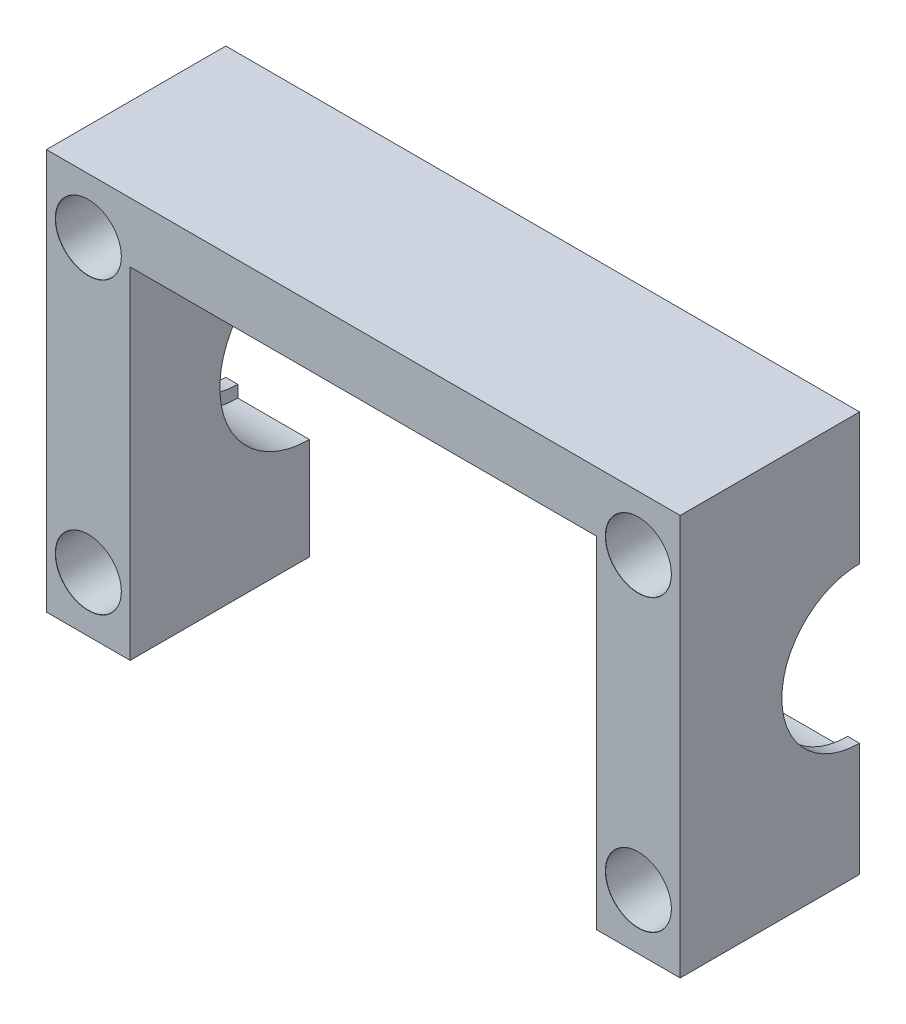
ISO-10303-21;
HEADER;
FILE_DESCRIPTION(('STEP AP214'),'2;1');
FILE_NAME('part.step','',(''),(''),'','','');
FILE_SCHEMA(('AUTOMOTIVE_DESIGN { 1 0 10303 214 1 1 1 1 }'));
ENDSEC;
DATA;
#1=APPLICATION_CONTEXT('core data for automotive mechanical design processes');
#2=APPLICATION_PROTOCOL_DEFINITION('international standard','automotive_design',2000,#1);
#3=PRODUCT_CONTEXT('',#1,'mechanical');
#4=PRODUCT('Part','Part','',(#3));
#5=PRODUCT_RELATED_PRODUCT_CATEGORY('part','',(#4));
#6=PRODUCT_DEFINITION_FORMATION('','',#4);
#7=PRODUCT_DEFINITION_CONTEXT('part definition',#1,'design');
#8=PRODUCT_DEFINITION('design','',#6,#7);
#9=PRODUCT_DEFINITION_SHAPE('','',#8);
#10=(LENGTH_UNIT() NAMED_UNIT(*) SI_UNIT(.MILLI.,.METRE.));
#11=(NAMED_UNIT(*) PLANE_ANGLE_UNIT() SI_UNIT($,.RADIAN.));
#12=(NAMED_UNIT(*) SI_UNIT($,.STERADIAN.) SOLID_ANGLE_UNIT());
#13=UNCERTAINTY_MEASURE_WITH_UNIT(LENGTH_MEASURE(1.E-05),#10,'distance_accuracy_value','');
#14=(GEOMETRIC_REPRESENTATION_CONTEXT(3) GLOBAL_UNCERTAINTY_ASSIGNED_CONTEXT((#13)) GLOBAL_UNIT_ASSIGNED_CONTEXT((#10,
#11,#12)) REPRESENTATION_CONTEXT('',''));
#15=CARTESIAN_POINT('',(0.,0.,0.));
#16=DIRECTION('',(0.,0.,1.));
#17=DIRECTION('',(1.,0.,0.));
#18=AXIS2_PLACEMENT_3D('',#15,#16,#17);
#19=CARTESIAN_POINT('',(0.,0.,0.));
#20=DIRECTION('',(0.,0.,-1.));
#21=DIRECTION('',(-1.,0.,0.));
#22=AXIS2_PLACEMENT_3D('',#19,#20,#21);
#23=PLANE('',#22);
#24=CARTESIAN_POINT('',(99.,57.75,0.));
#25=DIRECTION('',(0.,0.,1.));
#26=DIRECTION('',(1.,0.,0.));
#27=AXIS2_PLACEMENT_3D('',#24,#25,#26);
#28=CIRCLE('',#27,3.29999999999998);
#29=CARTESIAN_POINT('',(102.3,57.75,0.));
#30=VERTEX_POINT('',#29);
#31=EDGE_CURVE('E347',#30,#30,#28,.T.);
#32=ORIENTED_EDGE('',*,*,#31,.T.);
#33=EDGE_LOOP('',(#32));
#34=FACE_BOUND('',#33,.T.);
#35=CARTESIAN_POINT('',(6.99999999999999,57.75,0.));
#36=DIRECTION('',(0.,0.,1.));
#37=DIRECTION('',(1.,0.,0.));
#38=AXIS2_PLACEMENT_3D('',#35,#36,#37);
#39=CIRCLE('',#38,3.29999999999999);
#40=CARTESIAN_POINT('',(10.3,57.75,0.));
#41=VERTEX_POINT('',#40);
#42=EDGE_CURVE('E327',#41,#41,#39,.T.);
#43=ORIENTED_EDGE('',*,*,#42,.T.);
#44=EDGE_LOOP('',(#43));
#45=FACE_BOUND('',#44,.T.);
#46=DIRECTION('',(1.,0.,0.));
#47=VECTOR('',#46,1.);
#48=CARTESIAN_POINT('',(113.408800735218,47.,0.));
#49=LINE('',#48,#47);
#50=CARTESIAN_POINT('',(92.,47.,0.));
#51=VERTEX_POINT('',#50);
#52=CARTESIAN_POINT('',(104.,47.,0.));
#53=VERTEX_POINT('',#52);
#54=EDGE_CURVE('E11',#51,#53,#49,.T.);
#55=ORIENTED_EDGE('',*,*,#54,.F.);
#56=DIRECTION('',(0.,-1.,0.));
#57=VECTOR('',#56,1.);
#58=CARTESIAN_POINT('',(92.,0.,0.));
#59=LINE('',#58,#57);
#60=CARTESIAN_POINT('',(92.,57.,0.));
#61=VERTEX_POINT('',#60);
#62=EDGE_CURVE('E246',#61,#51,#59,.T.);
#63=ORIENTED_EDGE('',*,*,#62,.F.);
#64=DIRECTION('',(1.,0.,0.));
#65=VECTOR('',#64,1.);
#66=CARTESIAN_POINT('',(92.,57.,0.));
#67=LINE('',#66,#65);
#68=CARTESIAN_POINT('',(14.,57.,0.));
#69=VERTEX_POINT('',#68);
#70=EDGE_CURVE('E251',#69,#61,#67,.T.);
#71=ORIENTED_EDGE('',*,*,#70,.F.);
#72=DIRECTION('',(0.,1.,0.));
#73=VECTOR('',#72,1.);
#74=CARTESIAN_POINT('',(14.,57.,0.));
#75=LINE('',#74,#73);
#76=CARTESIAN_POINT('',(14.,47.,0.));
#77=VERTEX_POINT('',#76);
#78=EDGE_CURVE('E258',#77,#69,#75,.T.);
#79=ORIENTED_EDGE('',*,*,#78,.F.);
#80=CARTESIAN_POINT('',(2.,47.,0.));
#81=VERTEX_POINT('',#80);
#82=EDGE_CURVE('E57',#81,#77,#49,.T.);
#83=ORIENTED_EDGE('',*,*,#82,.F.);
#84=DIRECTION('',(0.,1.,0.));
#85=VECTOR('',#84,1.);
#86=CARTESIAN_POINT('',(2.,0.,0.));
#87=LINE('',#86,#85);
#88=CARTESIAN_POINT('',(2.,45.,0.));
#89=VERTEX_POINT('',#88);
#90=EDGE_CURVE('E168',#89,#81,#87,.T.);
#91=ORIENTED_EDGE('',*,*,#90,.F.);
#92=DIRECTION('',(1.,0.,0.));
#93=VECTOR('',#92,1.);
#94=CARTESIAN_POINT('',(113.408800735218,45.,0.));
#95=LINE('',#94,#93);
#96=CARTESIAN_POINT('',(0.,45.,0.));
#97=VERTEX_POINT('',#96);
#98=EDGE_CURVE('E159',#97,#89,#95,.T.);
#99=ORIENTED_EDGE('',*,*,#98,.F.);
#100=DIRECTION('',(0.,-1.,0.));
#101=VECTOR('',#100,1.);
#102=CARTESIAN_POINT('',(0.,0.,0.));
#103=LINE('',#102,#101);
#104=CARTESIAN_POINT('',(0.,67.,0.));
#105=VERTEX_POINT('',#104);
#106=EDGE_CURVE('E230',#105,#97,#103,.T.);
#107=ORIENTED_EDGE('',*,*,#106,.F.);
#108=DIRECTION('',(-1.,0.,0.));
#109=VECTOR('',#108,1.);
#110=CARTESIAN_POINT('',(0.,67.,0.));
#111=LINE('',#110,#109);
#112=CARTESIAN_POINT('',(106.,67.,0.));
#113=VERTEX_POINT('',#112);
#114=EDGE_CURVE('E235',#113,#105,#111,.T.);
#115=ORIENTED_EDGE('',*,*,#114,.F.);
#116=DIRECTION('',(0.,1.,0.));
#117=VECTOR('',#116,1.);
#118=CARTESIAN_POINT('',(106.,67.,0.));
#119=LINE('',#118,#117);
#120=CARTESIAN_POINT('',(106.,45.,0.));
#121=VERTEX_POINT('',#120);
#122=EDGE_CURVE('E242',#121,#113,#119,.T.);
#123=ORIENTED_EDGE('',*,*,#122,.F.);
#124=DIRECTION('',(1.,0.,0.));
#125=VECTOR('',#124,1.);
#126=CARTESIAN_POINT('',(113.408800735218,45.,0.));
#127=LINE('',#126,#125);
#128=CARTESIAN_POINT('',(104.,45.,0.));
#129=VERTEX_POINT('',#128);
#130=EDGE_CURVE('E49',#129,#121,#127,.T.);
#131=ORIENTED_EDGE('',*,*,#130,.F.);
#132=DIRECTION('',(0.,-1.,0.));
#133=VECTOR('',#132,1.);
#134=CARTESIAN_POINT('',(104.,0.,0.));
#135=LINE('',#134,#133);
#136=EDGE_CURVE('E55',#53,#129,#135,.T.);
#137=ORIENTED_EDGE('',*,*,#136,.F.);
#138=EDGE_LOOP('',(#55,#63,#71,#79,#83,#91,#99,#107,#115,#123,#131,#137));
#139=FACE_BOUND('',#138,.T.);
#140=ADVANCED_FACE('F45',(#34,#45,#139),#23,.T.);
#141=CARTESIAN_POINT('',(99.,9.25,0.));
#142=DIRECTION('',(0.,0.,1.));
#143=DIRECTION('',(1.,0.,0.));
#144=AXIS2_PLACEMENT_3D('',#141,#142,#143);
#145=CIRCLE('',#144,3.29999999999998);
#146=CARTESIAN_POINT('',(102.3,9.25,0.));
#147=VERTEX_POINT('',#146);
#148=EDGE_CURVE('E180',#147,#147,#145,.T.);
#149=ORIENTED_EDGE('',*,*,#148,.T.);
#150=EDGE_LOOP('',(#149));
#151=FACE_BOUND('',#150,.T.);
#152=DIRECTION('',(1.,0.,0.));
#153=VECTOR('',#152,1.);
#154=CARTESIAN_POINT('',(113.408800735218,17.,0.));
#155=LINE('',#154,#153);
#156=CARTESIAN_POINT('',(104.,17.,0.));
#157=VERTEX_POINT('',#156);
#158=CARTESIAN_POINT('',(92.,17.,0.));
#159=VERTEX_POINT('',#158);
#160=EDGE_CURVE('E195',#157,#159,#155,.F.);
#161=ORIENTED_EDGE('',*,*,#160,.F.);
#162=CARTESIAN_POINT('',(104.,19.,0.));
#163=VERTEX_POINT('',#162);
#164=EDGE_CURVE('E454',#163,#157,#135,.T.);
#165=ORIENTED_EDGE('',*,*,#164,.F.);
#166=DIRECTION('',(1.,0.,0.));
#167=VECTOR('',#166,1.);
#168=CARTESIAN_POINT('',(113.408800735218,19.,0.));
#169=LINE('',#168,#167);
#170=CARTESIAN_POINT('',(106.,19.,0.));
#171=VERTEX_POINT('',#170);
#172=EDGE_CURVE('E188',#171,#163,#169,.F.);
#173=ORIENTED_EDGE('',*,*,#172,.F.);
#174=CARTESIAN_POINT('',(106.,0.,0.));
#175=VERTEX_POINT('',#174);
#176=EDGE_CURVE('E238',#175,#171,#119,.T.);
#177=ORIENTED_EDGE('',*,*,#176,.F.);
#178=DIRECTION('',(1.,0.,0.));
#179=VECTOR('',#178,1.);
#180=CARTESIAN_POINT('',(106.,0.,0.));
#181=LINE('',#180,#179);
#182=CARTESIAN_POINT('',(92.,0.,0.));
#183=VERTEX_POINT('',#182);
#184=EDGE_CURVE('E243',#183,#175,#181,.T.);
#185=ORIENTED_EDGE('',*,*,#184,.F.);
#186=EDGE_CURVE('E250',#159,#183,#59,.T.);
#187=ORIENTED_EDGE('',*,*,#186,.F.);
#188=EDGE_LOOP('',(#161,#165,#173,#177,#185,#187));
#189=FACE_BOUND('',#188,.T.);
#190=ADVANCED_FACE('F466',(#151,#189),#23,.T.);
#191=CARTESIAN_POINT('',(14.,0.,30.));
#192=DIRECTION('',(0.,1.,0.));
#193=DIRECTION('',(0.,0.,1.));
#194=AXIS2_PLACEMENT_3D('',#191,#192,#193);
#195=PLANE('',#194);
#196=DIRECTION('',(1.,0.,0.));
#197=VECTOR('',#196,1.);
#198=CARTESIAN_POINT('',(14.,0.,0.));
#199=LINE('',#198,#197);
#200=CARTESIAN_POINT('',(0.,0.,0.));
#201=VERTEX_POINT('',#200);
#202=CARTESIAN_POINT('',(14.,0.,0.));
#203=VERTEX_POINT('',#202);
#204=EDGE_CURVE('E259',#201,#203,#199,.T.);
#205=ORIENTED_EDGE('',*,*,#204,.T.);
#206=DIRECTION('',(0.,0.,-1.));
#207=VECTOR('',#206,1.);
#208=CARTESIAN_POINT('',(14.,0.,30.));
#209=LINE('',#208,#207);
#210=CARTESIAN_POINT('',(14.,0.,30.));
#211=VERTEX_POINT('',#210);
#212=EDGE_CURVE('E196',#211,#203,#209,.T.);
#213=ORIENTED_EDGE('',*,*,#212,.F.);
#214=DIRECTION('',(1.,0.,0.));
#215=VECTOR('',#214,1.);
#216=CARTESIAN_POINT('',(14.,0.,30.));
#217=LINE('',#216,#215);
#218=CARTESIAN_POINT('',(0.,0.,30.));
#219=VERTEX_POINT('',#218);
#220=EDGE_CURVE('E233',#219,#211,#217,.T.);
#221=ORIENTED_EDGE('',*,*,#220,.F.);
#222=DIRECTION('',(0.,0.,-1.));
#223=VECTOR('',#222,1.);
#224=CARTESIAN_POINT('',(0.,0.,30.));
#225=LINE('',#224,#223);
#226=EDGE_CURVE('E225',#219,#201,#225,.T.);
#227=ORIENTED_EDGE('',*,*,#226,.T.);
#228=EDGE_LOOP('',(#205,#213,#221,#227));
#229=FACE_BOUND('',#228,.T.);
#230=ADVANCED_FACE('F47',(#229),#195,.F.);
#231=CARTESIAN_POINT('',(14.,57.,30.));
#232=DIRECTION('',(-1.,0.,0.));
#233=DIRECTION('',(0.,-1.,0.));
#234=AXIS2_PLACEMENT_3D('',#231,#232,#233);
#235=PLANE('',#234);
#236=CARTESIAN_POINT('',(14.,17.,0.));
#237=VERTEX_POINT('',#236);
#238=EDGE_CURVE('E254',#203,#237,#75,.T.);
#239=ORIENTED_EDGE('',*,*,#238,.T.);
#240=CARTESIAN_POINT('',(14.,32.,0.));
#241=DIRECTION('',(-1.,0.,0.));
#242=DIRECTION('',(0.,-1.,0.));
#243=AXIS2_PLACEMENT_3D('',#240,#241,#242);
#244=CIRCLE('',#243,15.);
#245=EDGE_CURVE('E290',#237,#77,#244,.T.);
#246=ORIENTED_EDGE('',*,*,#245,.T.);
#247=ORIENTED_EDGE('',*,*,#78,.T.);
#248=DIRECTION('',(0.,0.,-1.));
#249=VECTOR('',#248,1.);
#250=CARTESIAN_POINT('',(14.,57.,30.));
#251=LINE('',#250,#249);
#252=CARTESIAN_POINT('',(14.,57.,30.));
#253=VERTEX_POINT('',#252);
#254=EDGE_CURVE('E199',#253,#69,#251,.T.);
#255=ORIENTED_EDGE('',*,*,#254,.F.);
#256=DIRECTION('',(0.,1.,0.));
#257=VECTOR('',#256,1.);
#258=CARTESIAN_POINT('',(14.,57.,30.));
#259=LINE('',#258,#257);
#260=EDGE_CURVE('E281',#211,#253,#259,.T.);
#261=ORIENTED_EDGE('',*,*,#260,.F.);
#262=ORIENTED_EDGE('',*,*,#212,.T.);
#263=EDGE_LOOP('',(#239,#246,#247,#255,#261,#262));
#264=FACE_BOUND('',#263,.T.);
#265=ADVANCED_FACE('F410',(#264),#235,.F.);
#266=CARTESIAN_POINT('',(92.,57.,30.));
#267=DIRECTION('',(0.,1.,0.));
#268=DIRECTION('',(0.,0.,1.));
#269=AXIS2_PLACEMENT_3D('',#266,#267,#268);
#270=PLANE('',#269);
#271=ORIENTED_EDGE('',*,*,#70,.T.);
#272=DIRECTION('',(0.,0.,-1.));
#273=VECTOR('',#272,1.);
#274=CARTESIAN_POINT('',(92.,57.,30.));
#275=LINE('',#274,#273);
#276=CARTESIAN_POINT('',(92.,57.,30.));
#277=VERTEX_POINT('',#276);
#278=EDGE_CURVE('E205',#277,#61,#275,.T.);
#279=ORIENTED_EDGE('',*,*,#278,.F.);
#280=DIRECTION('',(1.,0.,0.));
#281=VECTOR('',#280,1.);
#282=CARTESIAN_POINT('',(92.,57.,30.));
#283=LINE('',#282,#281);
#284=EDGE_CURVE('E278',#253,#277,#283,.T.);
#285=ORIENTED_EDGE('',*,*,#284,.F.);
#286=ORIENTED_EDGE('',*,*,#254,.T.);
#287=EDGE_LOOP('',(#271,#279,#285,#286));
#288=FACE_BOUND('',#287,.T.);
#289=ADVANCED_FACE('F415',(#288),#270,.F.);
#290=CARTESIAN_POINT('',(92.,0.,30.));
#291=DIRECTION('',(1.,0.,0.));
#292=DIRECTION('',(0.,0.,-1.));
#293=AXIS2_PLACEMENT_3D('',#290,#291,#292);
#294=PLANE('',#293);
#295=ORIENTED_EDGE('',*,*,#62,.T.);
#296=CARTESIAN_POINT('',(92.,32.,0.));
#297=DIRECTION('',(1.,0.,0.));
#298=DIRECTION('',(0.,0.,-1.));
#299=AXIS2_PLACEMENT_3D('',#296,#297,#298);
#300=CIRCLE('',#299,15.);
#301=EDGE_CURVE('E263',#51,#159,#300,.T.);
#302=ORIENTED_EDGE('',*,*,#301,.T.);
#303=ORIENTED_EDGE('',*,*,#186,.T.);
#304=DIRECTION('',(0.,0.,-1.));
#305=VECTOR('',#304,1.);
#306=CARTESIAN_POINT('',(92.,0.,30.));
#307=LINE('',#306,#305);
#308=CARTESIAN_POINT('',(92.,0.,30.));
#309=VERTEX_POINT('',#308);
#310=EDGE_CURVE('E209',#309,#183,#307,.T.);
#311=ORIENTED_EDGE('',*,*,#310,.F.);
#312=DIRECTION('',(0.,-1.,0.));
#313=VECTOR('',#312,1.);
#314=CARTESIAN_POINT('',(92.,0.,30.));
#315=LINE('',#314,#313);
#316=EDGE_CURVE('E275',#277,#309,#315,.T.);
#317=ORIENTED_EDGE('',*,*,#316,.F.);
#318=ORIENTED_EDGE('',*,*,#278,.T.);
#319=EDGE_LOOP('',(#295,#302,#303,#311,#317,#318));
#320=FACE_BOUND('',#319,.T.);
#321=ADVANCED_FACE('F421',(#320),#294,.F.);
#322=CARTESIAN_POINT('',(106.,0.,30.));
#323=DIRECTION('',(0.,1.,0.));
#324=DIRECTION('',(-1.,0.,0.));
#325=AXIS2_PLACEMENT_3D('',#322,#323,#324);
#326=PLANE('',#325);
#327=ORIENTED_EDGE('',*,*,#184,.T.);
#328=DIRECTION('',(0.,0.,-1.));
#329=VECTOR('',#328,1.);
#330=CARTESIAN_POINT('',(106.,0.,30.));
#331=LINE('',#330,#329);
#332=CARTESIAN_POINT('',(106.,0.,30.));
#333=VERTEX_POINT('',#332);
#334=EDGE_CURVE('E213',#333,#175,#331,.T.);
#335=ORIENTED_EDGE('',*,*,#334,.F.);
#336=DIRECTION('',(1.,0.,0.));
#337=VECTOR('',#336,1.);
#338=CARTESIAN_POINT('',(106.,0.,30.));
#339=LINE('',#338,#337);
#340=EDGE_CURVE('E272',#309,#333,#339,.T.);
#341=ORIENTED_EDGE('',*,*,#340,.F.);
#342=ORIENTED_EDGE('',*,*,#310,.T.);
#343=EDGE_LOOP('',(#327,#335,#341,#342));
#344=FACE_BOUND('',#343,.T.);
#345=ADVANCED_FACE('F425',(#344),#326,.F.);
#346=CARTESIAN_POINT('',(106.,67.,30.));
#347=DIRECTION('',(-1.,0.,0.));
#348=DIRECTION('',(0.,-1.,0.));
#349=AXIS2_PLACEMENT_3D('',#346,#347,#348);
#350=PLANE('',#349);
#351=ORIENTED_EDGE('',*,*,#176,.T.);
#352=CARTESIAN_POINT('',(106.,32.,0.));
#353=DIRECTION('',(-1.,0.,0.));
#354=DIRECTION('',(0.,-1.,0.));
#355=AXIS2_PLACEMENT_3D('',#352,#353,#354);
#356=CIRCLE('',#355,13.);
#357=EDGE_CURVE('E72',#171,#121,#356,.T.);
#358=ORIENTED_EDGE('',*,*,#357,.T.);
#359=ORIENTED_EDGE('',*,*,#122,.T.);
#360=DIRECTION('',(0.,0.,-1.));
#361=VECTOR('',#360,1.);
#362=CARTESIAN_POINT('',(106.,67.,30.));
#363=LINE('',#362,#361);
#364=CARTESIAN_POINT('',(106.,67.,30.));
#365=VERTEX_POINT('',#364);
#366=EDGE_CURVE('E217',#365,#113,#363,.T.);
#367=ORIENTED_EDGE('',*,*,#366,.F.);
#368=DIRECTION('',(0.,1.,0.));
#369=VECTOR('',#368,1.);
#370=CARTESIAN_POINT('',(106.,67.,30.));
#371=LINE('',#370,#369);
#372=EDGE_CURVE('E269',#333,#365,#371,.T.);
#373=ORIENTED_EDGE('',*,*,#372,.F.);
#374=ORIENTED_EDGE('',*,*,#334,.T.);
#375=EDGE_LOOP('',(#351,#358,#359,#367,#373,#374));
#376=FACE_BOUND('',#375,.T.);
#377=ADVANCED_FACE('F430',(#376),#350,.F.);
#378=CARTESIAN_POINT('',(0.,67.,30.));
#379=DIRECTION('',(0.,-1.,0.));
#380=DIRECTION('',(0.,0.,-1.));
#381=AXIS2_PLACEMENT_3D('',#378,#379,#380);
#382=PLANE('',#381);
#383=ORIENTED_EDGE('',*,*,#114,.T.);
#384=DIRECTION('',(0.,0.,-1.));
#385=VECTOR('',#384,1.);
#386=CARTESIAN_POINT('',(0.,67.,30.));
#387=LINE('',#386,#385);
#388=CARTESIAN_POINT('',(0.,67.,30.));
#389=VERTEX_POINT('',#388);
#390=EDGE_CURVE('E221',#389,#105,#387,.T.);
#391=ORIENTED_EDGE('',*,*,#390,.F.);
#392=DIRECTION('',(-1.,0.,0.));
#393=VECTOR('',#392,1.);
#394=CARTESIAN_POINT('',(0.,67.,30.));
#395=LINE('',#394,#393);
#396=EDGE_CURVE('E266',#365,#389,#395,.T.);
#397=ORIENTED_EDGE('',*,*,#396,.F.);
#398=ORIENTED_EDGE('',*,*,#366,.T.);
#399=EDGE_LOOP('',(#383,#391,#397,#398));
#400=FACE_BOUND('',#399,.T.);
#401=ADVANCED_FACE('F434',(#400),#382,.F.);
#402=CARTESIAN_POINT('',(0.,0.,30.));
#403=DIRECTION('',(1.,0.,0.));
#404=DIRECTION('',(0.,0.,-1.));
#405=AXIS2_PLACEMENT_3D('',#402,#403,#404);
#406=PLANE('',#405);
#407=ORIENTED_EDGE('',*,*,#106,.T.);
#408=CARTESIAN_POINT('',(0.,32.,0.));
#409=DIRECTION('',(1.,0.,0.));
#410=DIRECTION('',(0.,0.,-1.));
#411=AXIS2_PLACEMENT_3D('',#408,#409,#410);
#412=CIRCLE('',#411,13.);
#413=CARTESIAN_POINT('',(0.,19.,0.));
#414=VERTEX_POINT('',#413);
#415=EDGE_CURVE('E162',#97,#414,#412,.T.);
#416=ORIENTED_EDGE('',*,*,#415,.T.);
#417=EDGE_CURVE('E234',#414,#201,#103,.T.);
#418=ORIENTED_EDGE('',*,*,#417,.T.);
#419=ORIENTED_EDGE('',*,*,#226,.F.);
#420=DIRECTION('',(0.,-1.,0.));
#421=VECTOR('',#420,1.);
#422=CARTESIAN_POINT('',(0.,0.,30.));
#423=LINE('',#422,#421);
#424=EDGE_CURVE('E229',#389,#219,#423,.T.);
#425=ORIENTED_EDGE('',*,*,#424,.F.);
#426=ORIENTED_EDGE('',*,*,#390,.T.);
#427=EDGE_LOOP('',(#407,#416,#418,#419,#425,#426));
#428=FACE_BOUND('',#427,.T.);
#429=ADVANCED_FACE('F394',(#428),#406,.F.);
#430=CARTESIAN_POINT('',(0.,0.,30.));
#431=DIRECTION('',(0.,0.,-1.));
#432=DIRECTION('',(-1.,0.,0.));
#433=AXIS2_PLACEMENT_3D('',#430,#431,#432);
#434=PLANE('',#433);
#435=CARTESIAN_POINT('',(7.,9.25,30.));
#436=DIRECTION('',(0.,0.,1.));
#437=DIRECTION('',(1.,0.,0.));
#438=AXIS2_PLACEMENT_3D('',#435,#436,#437);
#439=CIRCLE('',#438,5.525);
#440=CARTESIAN_POINT('',(12.525,9.25,30.));
#441=VERTEX_POINT('',#440);
#442=EDGE_CURVE('E383',#441,#441,#439,.T.);
#443=ORIENTED_EDGE('',*,*,#442,.F.);
#444=EDGE_LOOP('',(#443));
#445=FACE_BOUND('',#444,.T.);
#446=CARTESIAN_POINT('',(99.,57.75,30.));
#447=DIRECTION('',(0.,0.,1.));
#448=DIRECTION('',(1.,0.,0.));
#449=AXIS2_PLACEMENT_3D('',#446,#447,#448);
#450=CIRCLE('',#449,5.525);
#451=CARTESIAN_POINT('',(104.525,57.75,30.));
#452=VERTEX_POINT('',#451);
#453=EDGE_CURVE('E363',#452,#452,#450,.T.);
#454=ORIENTED_EDGE('',*,*,#453,.F.);
#455=EDGE_LOOP('',(#454));
#456=FACE_BOUND('',#455,.T.);
#457=CARTESIAN_POINT('',(6.99999999999999,57.75,30.));
#458=DIRECTION('',(0.,0.,1.));
#459=DIRECTION('',(1.,0.,0.));
#460=AXIS2_PLACEMENT_3D('',#457,#458,#459);
#461=CIRCLE('',#460,5.525);
#462=CARTESIAN_POINT('',(12.525,57.75,30.));
#463=VERTEX_POINT('',#462);
#464=EDGE_CURVE('E343',#463,#463,#461,.T.);
#465=ORIENTED_EDGE('',*,*,#464,.F.);
#466=EDGE_LOOP('',(#465));
#467=FACE_BOUND('',#466,.T.);
#468=CARTESIAN_POINT('',(99.,9.25,30.));
#469=DIRECTION('',(0.,0.,1.));
#470=DIRECTION('',(1.,0.,0.));
#471=AXIS2_PLACEMENT_3D('',#468,#469,#470);
#472=CIRCLE('',#471,5.525);
#473=CARTESIAN_POINT('',(104.525,9.25,30.));
#474=VERTEX_POINT('',#473);
#475=EDGE_CURVE('E323',#474,#474,#472,.T.);
#476=ORIENTED_EDGE('',*,*,#475,.F.);
#477=EDGE_LOOP('',(#476));
#478=FACE_BOUND('',#477,.T.);
#479=ORIENTED_EDGE('',*,*,#220,.T.);
#480=ORIENTED_EDGE('',*,*,#260,.T.);
#481=ORIENTED_EDGE('',*,*,#284,.T.);
#482=ORIENTED_EDGE('',*,*,#316,.T.);
#483=ORIENTED_EDGE('',*,*,#340,.T.);
#484=ORIENTED_EDGE('',*,*,#372,.T.);
#485=ORIENTED_EDGE('',*,*,#396,.T.);
#486=ORIENTED_EDGE('',*,*,#424,.T.);
#487=EDGE_LOOP('',(#479,#480,#481,#482,#483,#484,#485,#486));
#488=FACE_BOUND('',#487,.T.);
#489=ADVANCED_FACE('F390',(#445,#456,#467,#478,#488),#434,.F.);
#490=CARTESIAN_POINT('',(7.,9.25,0.));
#491=DIRECTION('',(0.,0.,1.));
#492=DIRECTION('',(1.,0.,0.));
#493=AXIS2_PLACEMENT_3D('',#490,#491,#492);
#494=CIRCLE('',#493,3.29999999999999);
#495=CARTESIAN_POINT('',(10.3,9.25,0.));
#496=VERTEX_POINT('',#495);
#497=EDGE_CURVE('E367',#496,#496,#494,.T.);
#498=ORIENTED_EDGE('',*,*,#497,.T.);
#499=EDGE_LOOP('',(#498));
#500=FACE_BOUND('',#499,.T.);
#501=CARTESIAN_POINT('',(2.,17.,0.));
#502=VERTEX_POINT('',#501);
#503=EDGE_CURVE('E169',#237,#502,#155,.F.);
#504=ORIENTED_EDGE('',*,*,#503,.F.);
#505=ORIENTED_EDGE('',*,*,#238,.F.);
#506=ORIENTED_EDGE('',*,*,#204,.F.);
#507=ORIENTED_EDGE('',*,*,#417,.F.);
#508=DIRECTION('',(1.,0.,0.));
#509=VECTOR('',#508,1.);
#510=CARTESIAN_POINT('',(113.408800735218,19.,0.));
#511=LINE('',#510,#509);
#512=CARTESIAN_POINT('',(2.,19.,0.));
#513=VERTEX_POINT('',#512);
#514=EDGE_CURVE('E192',#513,#414,#511,.F.);
#515=ORIENTED_EDGE('',*,*,#514,.F.);
#516=EDGE_CURVE('E176',#502,#513,#87,.T.);
#517=ORIENTED_EDGE('',*,*,#516,.F.);
#518=EDGE_LOOP('',(#504,#505,#506,#507,#515,#517));
#519=FACE_BOUND('',#518,.T.);
#520=ADVANCED_FACE('F393',(#500,#519),#23,.T.);
#521=CARTESIAN_POINT('',(113.408800735218,32.,0.));
#522=DIRECTION('',(1.,0.,0.));
#523=DIRECTION('',(0.,0.,-1.));
#524=AXIS2_PLACEMENT_3D('',#521,#522,#523);
#525=CYLINDRICAL_SURFACE('',#524,13.);
#526=ORIENTED_EDGE('',*,*,#98,.T.);
#527=CARTESIAN_POINT('',(2.,32.,0.));
#528=DIRECTION('',(1.,0.,0.));
#529=DIRECTION('',(0.,0.,-1.));
#530=AXIS2_PLACEMENT_3D('',#527,#528,#529);
#531=CIRCLE('',#530,13.);
#532=EDGE_CURVE('E64',#89,#513,#531,.T.);
#533=ORIENTED_EDGE('',*,*,#532,.T.);
#534=ORIENTED_EDGE('',*,*,#514,.T.);
#535=ORIENTED_EDGE('',*,*,#415,.F.);
#536=EDGE_LOOP('',(#526,#533,#534,#535));
#537=FACE_BOUND('',#536,.T.);
#538=ADVANCED_FACE('F160',(#537),#525,.F.);
#539=CARTESIAN_POINT('',(113.408800735218,32.,0.));
#540=DIRECTION('',(1.,0.,0.));
#541=DIRECTION('',(0.,0.,-1.));
#542=AXIS2_PLACEMENT_3D('',#539,#540,#541);
#543=CYLINDRICAL_SURFACE('',#542,15.);
#544=ORIENTED_EDGE('',*,*,#82,.T.);
#545=ORIENTED_EDGE('',*,*,#245,.F.);
#546=ORIENTED_EDGE('',*,*,#503,.T.);
#547=CARTESIAN_POINT('',(2.,32.,0.));
#548=DIRECTION('',(1.,0.,0.));
#549=DIRECTION('',(0.,0.,-1.));
#550=AXIS2_PLACEMENT_3D('',#547,#548,#549);
#551=CIRCLE('',#550,15.);
#552=EDGE_CURVE('E298',#81,#502,#551,.T.);
#553=ORIENTED_EDGE('',*,*,#552,.F.);
#554=EDGE_LOOP('',(#544,#545,#546,#553));
#555=FACE_BOUND('',#554,.T.);
#556=ADVANCED_FACE('F441',(#555),#543,.F.);
#557=CARTESIAN_POINT('',(2.,17.,0.));
#558=DIRECTION('',(-1.,0.,0.));
#559=DIRECTION('',(0.,0.,1.));
#560=AXIS2_PLACEMENT_3D('',#557,#558,#559);
#561=PLANE('',#560);
#562=ORIENTED_EDGE('',*,*,#516,.T.);
#563=ORIENTED_EDGE('',*,*,#532,.F.);
#564=ORIENTED_EDGE('',*,*,#90,.T.);
#565=ORIENTED_EDGE('',*,*,#552,.T.);
#566=EDGE_LOOP('',(#562,#563,#564,#565));
#567=FACE_BOUND('',#566,.T.);
#568=ADVANCED_FACE('F172',(#567),#561,.F.);
#569=ORIENTED_EDGE('',*,*,#54,.T.);
#570=CARTESIAN_POINT('',(104.,32.,0.));
#571=DIRECTION('',(1.,0.,0.));
#572=DIRECTION('',(0.,0.,-1.));
#573=AXIS2_PLACEMENT_3D('',#570,#571,#572);
#574=CIRCLE('',#573,15.);
#575=EDGE_CURVE('E301',#53,#157,#574,.T.);
#576=ORIENTED_EDGE('',*,*,#575,.T.);
#577=ORIENTED_EDGE('',*,*,#160,.T.);
#578=ORIENTED_EDGE('',*,*,#301,.F.);
#579=EDGE_LOOP('',(#569,#576,#577,#578));
#580=FACE_BOUND('',#579,.T.);
#581=ADVANCED_FACE('F559',(#580),#543,.F.);
#582=CARTESIAN_POINT('',(104.,19.,0.));
#583=DIRECTION('',(1.,0.,0.));
#584=DIRECTION('',(0.,0.,-1.));
#585=AXIS2_PLACEMENT_3D('',#582,#583,#584);
#586=PLANE('',#585);
#587=ORIENTED_EDGE('',*,*,#136,.T.);
#588=CARTESIAN_POINT('',(104.,32.,0.));
#589=DIRECTION('',(1.,0.,0.));
#590=DIRECTION('',(0.,0.,-1.));
#591=AXIS2_PLACEMENT_3D('',#588,#589,#590);
#592=CIRCLE('',#591,13.);
#593=EDGE_CURVE('E179',#129,#163,#592,.T.);
#594=ORIENTED_EDGE('',*,*,#593,.T.);
#595=ORIENTED_EDGE('',*,*,#164,.T.);
#596=ORIENTED_EDGE('',*,*,#575,.F.);
#597=EDGE_LOOP('',(#587,#594,#595,#596));
#598=FACE_BOUND('',#597,.T.);
#599=ADVANCED_FACE('F464',(#598),#586,.F.);
#600=CARTESIAN_POINT('',(113.408800735218,32.,0.));
#601=DIRECTION('',(1.,0.,0.));
#602=DIRECTION('',(0.,0.,-1.));
#603=AXIS2_PLACEMENT_3D('',#600,#601,#602);
#604=CYLINDRICAL_SURFACE('',#603,13.);
#605=ORIENTED_EDGE('',*,*,#130,.T.);
#606=ORIENTED_EDGE('',*,*,#357,.F.);
#607=ORIENTED_EDGE('',*,*,#172,.T.);
#608=ORIENTED_EDGE('',*,*,#593,.F.);
#609=EDGE_LOOP('',(#605,#606,#607,#608));
#610=FACE_BOUND('',#609,.T.);
#611=ADVANCED_FACE('F460',(#610),#604,.F.);
#612=CARTESIAN_POINT('',(99.,9.25,30.));
#613=DIRECTION('',(0.,0.,1.));
#614=DIRECTION('',(1.,0.,0.));
#615=AXIS2_PLACEMENT_3D('',#612,#613,#614);
#616=CYLINDRICAL_SURFACE('',#615,3.29999999999999);
#617=ORIENTED_EDGE('',*,*,#148,.F.);
#618=EDGE_LOOP('',(#617));
#619=FACE_BOUND('',#618,.T.);
#620=CARTESIAN_POINT('',(99.,9.25,20.6));
#621=DIRECTION('',(0.,0.,1.));
#622=DIRECTION('',(1.,0.,0.));
#623=AXIS2_PLACEMENT_3D('',#620,#621,#622);
#624=CIRCLE('',#623,3.3);
#625=CARTESIAN_POINT('',(102.3,9.25,20.6));
#626=VERTEX_POINT('',#625);
#627=EDGE_CURVE('E311',#626,#626,#624,.T.);
#628=ORIENTED_EDGE('',*,*,#627,.T.);
#629=EDGE_LOOP('',(#628));
#630=FACE_BOUND('',#629,.T.);
#631=ADVANCED_FACE('F551',(#619,#630),#616,.F.);
#632=CARTESIAN_POINT('',(104.5,9.25,20.6));
#633=DIRECTION('',(0.,0.,-1.));
#634=DIRECTION('',(-1.,0.,0.));
#635=AXIS2_PLACEMENT_3D('',#632,#633,#634);
#636=PLANE('',#635);
#637=ORIENTED_EDGE('',*,*,#627,.F.);
#638=EDGE_LOOP('',(#637));
#639=FACE_BOUND('',#638,.T.);
#640=CARTESIAN_POINT('',(99.,9.25,20.6));
#641=DIRECTION('',(0.,0.,1.));
#642=DIRECTION('',(1.,0.,0.));
#643=AXIS2_PLACEMENT_3D('',#640,#641,#642);
#644=CIRCLE('',#643,5.49999999999999);
#645=CARTESIAN_POINT('',(104.5,9.25,20.6));
#646=VERTEX_POINT('',#645);
#647=EDGE_CURVE('E315',#646,#646,#644,.T.);
#648=ORIENTED_EDGE('',*,*,#647,.T.);
#649=EDGE_LOOP('',(#648));
#650=FACE_BOUND('',#649,.T.);
#651=ADVANCED_FACE('F547',(#639,#650),#636,.F.);
#652=CARTESIAN_POINT('',(99.,9.25,30.));
#653=DIRECTION('',(0.,0.,1.));
#654=DIRECTION('',(1.,0.,0.));
#655=AXIS2_PLACEMENT_3D('',#652,#653,#654);
#656=CYLINDRICAL_SURFACE('',#655,5.49999999999999);
#657=ORIENTED_EDGE('',*,*,#647,.F.);
#658=EDGE_LOOP('',(#657));
#659=FACE_BOUND('',#658,.T.);
#660=CARTESIAN_POINT('',(99.,9.25,29.975));
#661=DIRECTION('',(0.,0.,1.));
#662=DIRECTION('',(1.,0.,0.));
#663=AXIS2_PLACEMENT_3D('',#660,#661,#662);
#664=CIRCLE('',#663,5.49999999999999);
#665=CARTESIAN_POINT('',(104.5,9.25,29.975));
#666=VERTEX_POINT('',#665);
#667=EDGE_CURVE('E319',#666,#666,#664,.T.);
#668=ORIENTED_EDGE('',*,*,#667,.T.);
#669=EDGE_LOOP('',(#668));
#670=FACE_BOUND('',#669,.T.);
#671=ADVANCED_FACE('F543',(#659,#670),#656,.F.);
#672=CARTESIAN_POINT('',(99.,9.25,30.));
#673=DIRECTION('',(0.,0.,1.));
#674=DIRECTION('',(1.,0.,0.));
#675=AXIS2_PLACEMENT_3D('',#672,#673,#674);
#676=CONICAL_SURFACE('',#675,5.525,0.785398163397587);
#677=ORIENTED_EDGE('',*,*,#667,.F.);
#678=EDGE_LOOP('',(#677));
#679=FACE_BOUND('',#678,.T.);
#680=ORIENTED_EDGE('',*,*,#475,.T.);
#681=EDGE_LOOP('',(#680));
#682=FACE_BOUND('',#681,.T.);
#683=ADVANCED_FACE('F539',(#679,#682),#676,.F.);
#684=CARTESIAN_POINT('',(6.99999999999999,57.75,30.));
#685=DIRECTION('',(0.,0.,1.));
#686=DIRECTION('',(1.,0.,0.));
#687=AXIS2_PLACEMENT_3D('',#684,#685,#686);
#688=CYLINDRICAL_SURFACE('',#687,3.3);
#689=ORIENTED_EDGE('',*,*,#42,.F.);
#690=EDGE_LOOP('',(#689));
#691=FACE_BOUND('',#690,.T.);
#692=CARTESIAN_POINT('',(6.99999999999999,57.75,20.6));
#693=DIRECTION('',(0.,0.,1.));
#694=DIRECTION('',(1.,0.,0.));
#695=AXIS2_PLACEMENT_3D('',#692,#693,#694);
#696=CIRCLE('',#695,3.3);
#697=CARTESIAN_POINT('',(10.3,57.75,20.6));
#698=VERTEX_POINT('',#697);
#699=EDGE_CURVE('E331',#698,#698,#696,.T.);
#700=ORIENTED_EDGE('',*,*,#699,.T.);
#701=EDGE_LOOP('',(#700));
#702=FACE_BOUND('',#701,.T.);
#703=ADVANCED_FACE('F535',(#691,#702),#688,.F.);
#704=CARTESIAN_POINT('',(12.5,57.75,20.6));
#705=DIRECTION('',(0.,0.,-1.));
#706=DIRECTION('',(-1.,0.,0.));
#707=AXIS2_PLACEMENT_3D('',#704,#705,#706);
#708=PLANE('',#707);
#709=ORIENTED_EDGE('',*,*,#699,.F.);
#710=EDGE_LOOP('',(#709));
#711=FACE_BOUND('',#710,.T.);
#712=CARTESIAN_POINT('',(6.99999999999999,57.75,20.6));
#713=DIRECTION('',(0.,0.,1.));
#714=DIRECTION('',(1.,0.,0.));
#715=AXIS2_PLACEMENT_3D('',#712,#713,#714);
#716=CIRCLE('',#715,5.5);
#717=CARTESIAN_POINT('',(12.5,57.75,20.6));
#718=VERTEX_POINT('',#717);
#719=EDGE_CURVE('E335',#718,#718,#716,.T.);
#720=ORIENTED_EDGE('',*,*,#719,.T.);
#721=EDGE_LOOP('',(#720));
#722=FACE_BOUND('',#721,.T.);
#723=ADVANCED_FACE('F531',(#711,#722),#708,.F.);
#724=CARTESIAN_POINT('',(6.99999999999999,57.75,30.));
#725=DIRECTION('',(0.,0.,1.));
#726=DIRECTION('',(1.,0.,0.));
#727=AXIS2_PLACEMENT_3D('',#724,#725,#726);
#728=CYLINDRICAL_SURFACE('',#727,5.5);
#729=ORIENTED_EDGE('',*,*,#719,.F.);
#730=EDGE_LOOP('',(#729));
#731=FACE_BOUND('',#730,.T.);
#732=CARTESIAN_POINT('',(6.99999999999999,57.75,29.975));
#733=DIRECTION('',(0.,0.,1.));
#734=DIRECTION('',(1.,0.,0.));
#735=AXIS2_PLACEMENT_3D('',#732,#733,#734);
#736=CIRCLE('',#735,5.5);
#737=CARTESIAN_POINT('',(12.5,57.75,29.975));
#738=VERTEX_POINT('',#737);
#739=EDGE_CURVE('E339',#738,#738,#736,.T.);
#740=ORIENTED_EDGE('',*,*,#739,.T.);
#741=EDGE_LOOP('',(#740));
#742=FACE_BOUND('',#741,.T.);
#743=ADVANCED_FACE('F527',(#731,#742),#728,.F.);
#744=CARTESIAN_POINT('',(6.99999999999999,57.75,30.));
#745=DIRECTION('',(0.,0.,1.));
#746=DIRECTION('',(1.,0.,0.));
#747=AXIS2_PLACEMENT_3D('',#744,#745,#746);
#748=CONICAL_SURFACE('',#747,5.525,0.785398163397448);
#749=ORIENTED_EDGE('',*,*,#739,.F.);
#750=EDGE_LOOP('',(#749));
#751=FACE_BOUND('',#750,.T.);
#752=ORIENTED_EDGE('',*,*,#464,.T.);
#753=EDGE_LOOP('',(#752));
#754=FACE_BOUND('',#753,.T.);
#755=ADVANCED_FACE('F523',(#751,#754),#748,.F.);
#756=CARTESIAN_POINT('',(99.,57.75,30.));
#757=DIRECTION('',(0.,0.,1.));
#758=DIRECTION('',(1.,0.,0.));
#759=AXIS2_PLACEMENT_3D('',#756,#757,#758);
#760=CYLINDRICAL_SURFACE('',#759,3.29999999999999);
#761=ORIENTED_EDGE('',*,*,#31,.F.);
#762=EDGE_LOOP('',(#761));
#763=FACE_BOUND('',#762,.T.);
#764=CARTESIAN_POINT('',(99.,57.75,20.6));
#765=DIRECTION('',(0.,0.,1.));
#766=DIRECTION('',(1.,0.,0.));
#767=AXIS2_PLACEMENT_3D('',#764,#765,#766);
#768=CIRCLE('',#767,3.3);
#769=CARTESIAN_POINT('',(102.3,57.75,20.6));
#770=VERTEX_POINT('',#769);
#771=EDGE_CURVE('E351',#770,#770,#768,.T.);
#772=ORIENTED_EDGE('',*,*,#771,.T.);
#773=EDGE_LOOP('',(#772));
#774=FACE_BOUND('',#773,.T.);
#775=ADVANCED_FACE('F519',(#763,#774),#760,.F.);
#776=CARTESIAN_POINT('',(104.5,57.75,20.6));
#777=DIRECTION('',(0.,0.,-1.));
#778=DIRECTION('',(-1.,0.,0.));
#779=AXIS2_PLACEMENT_3D('',#776,#777,#778);
#780=PLANE('',#779);
#781=ORIENTED_EDGE('',*,*,#771,.F.);
#782=EDGE_LOOP('',(#781));
#783=FACE_BOUND('',#782,.T.);
#784=CARTESIAN_POINT('',(99.,57.75,20.6));
#785=DIRECTION('',(0.,0.,1.));
#786=DIRECTION('',(1.,0.,0.));
#787=AXIS2_PLACEMENT_3D('',#784,#785,#786);
#788=CIRCLE('',#787,5.49999999999999);
#789=CARTESIAN_POINT('',(104.5,57.75,20.6));
#790=VERTEX_POINT('',#789);
#791=EDGE_CURVE('E355',#790,#790,#788,.T.);
#792=ORIENTED_EDGE('',*,*,#791,.T.);
#793=EDGE_LOOP('',(#792));
#794=FACE_BOUND('',#793,.T.);
#795=ADVANCED_FACE('F515',(#783,#794),#780,.F.);
#796=CARTESIAN_POINT('',(99.,57.75,30.));
#797=DIRECTION('',(0.,0.,1.));
#798=DIRECTION('',(1.,0.,0.));
#799=AXIS2_PLACEMENT_3D('',#796,#797,#798);
#800=CYLINDRICAL_SURFACE('',#799,5.49999999999999);
#801=ORIENTED_EDGE('',*,*,#791,.F.);
#802=EDGE_LOOP('',(#801));
#803=FACE_BOUND('',#802,.T.);
#804=CARTESIAN_POINT('',(99.,57.75,29.975));
#805=DIRECTION('',(0.,0.,1.));
#806=DIRECTION('',(1.,0.,0.));
#807=AXIS2_PLACEMENT_3D('',#804,#805,#806);
#808=CIRCLE('',#807,5.49999999999999);
#809=CARTESIAN_POINT('',(104.5,57.75,29.975));
#810=VERTEX_POINT('',#809);
#811=EDGE_CURVE('E359',#810,#810,#808,.T.);
#812=ORIENTED_EDGE('',*,*,#811,.T.);
#813=EDGE_LOOP('',(#812));
#814=FACE_BOUND('',#813,.T.);
#815=ADVANCED_FACE('F511',(#803,#814),#800,.F.);
#816=CARTESIAN_POINT('',(99.,57.75,30.));
#817=DIRECTION('',(0.,0.,1.));
#818=DIRECTION('',(1.,0.,0.));
#819=AXIS2_PLACEMENT_3D('',#816,#817,#818);
#820=CONICAL_SURFACE('',#819,5.525,0.785398163397587);
#821=ORIENTED_EDGE('',*,*,#811,.F.);
#822=EDGE_LOOP('',(#821));
#823=FACE_BOUND('',#822,.T.);
#824=ORIENTED_EDGE('',*,*,#453,.T.);
#825=EDGE_LOOP('',(#824));
#826=FACE_BOUND('',#825,.T.);
#827=ADVANCED_FACE('F489',(#823,#826),#820,.F.);
#828=CARTESIAN_POINT('',(7.,9.25,30.));
#829=DIRECTION('',(0.,0.,1.));
#830=DIRECTION('',(1.,0.,0.));
#831=AXIS2_PLACEMENT_3D('',#828,#829,#830);
#832=CYLINDRICAL_SURFACE('',#831,3.29999999999999);
#833=ORIENTED_EDGE('',*,*,#497,.F.);
#834=EDGE_LOOP('',(#833));
#835=FACE_BOUND('',#834,.T.);
#836=CARTESIAN_POINT('',(7.,9.25,20.6));
#837=DIRECTION('',(0.,0.,1.));
#838=DIRECTION('',(1.,0.,0.));
#839=AXIS2_PLACEMENT_3D('',#836,#837,#838);
#840=CIRCLE('',#839,3.3);
#841=CARTESIAN_POINT('',(10.3,9.25,20.6));
#842=VERTEX_POINT('',#841);
#843=EDGE_CURVE('E371',#842,#842,#840,.T.);
#844=ORIENTED_EDGE('',*,*,#843,.T.);
#845=EDGE_LOOP('',(#844));
#846=FACE_BOUND('',#845,.T.);
#847=ADVANCED_FACE('F485',(#835,#846),#832,.F.);
#848=CARTESIAN_POINT('',(12.5,9.25,20.6));
#849=DIRECTION('',(0.,0.,-1.));
#850=DIRECTION('',(-1.,0.,0.));
#851=AXIS2_PLACEMENT_3D('',#848,#849,#850);
#852=PLANE('',#851);
#853=ORIENTED_EDGE('',*,*,#843,.F.);
#854=EDGE_LOOP('',(#853));
#855=FACE_BOUND('',#854,.T.);
#856=CARTESIAN_POINT('',(7.,9.25,20.6));
#857=DIRECTION('',(0.,0.,1.));
#858=DIRECTION('',(1.,0.,0.));
#859=AXIS2_PLACEMENT_3D('',#856,#857,#858);
#860=CIRCLE('',#859,5.5);
#861=CARTESIAN_POINT('',(12.5,9.25,20.6));
#862=VERTEX_POINT('',#861);
#863=EDGE_CURVE('E375',#862,#862,#860,.T.);
#864=ORIENTED_EDGE('',*,*,#863,.T.);
#865=EDGE_LOOP('',(#864));
#866=FACE_BOUND('',#865,.T.);
#867=ADVANCED_FACE('F488',(#855,#866),#852,.F.);
#868=CARTESIAN_POINT('',(7.,9.25,30.));
#869=DIRECTION('',(0.,0.,1.));
#870=DIRECTION('',(1.,0.,0.));
#871=AXIS2_PLACEMENT_3D('',#868,#869,#870);
#872=CYLINDRICAL_SURFACE('',#871,5.5);
#873=ORIENTED_EDGE('',*,*,#863,.F.);
#874=EDGE_LOOP('',(#873));
#875=FACE_BOUND('',#874,.T.);
#876=CARTESIAN_POINT('',(7.,9.25,29.975));
#877=DIRECTION('',(0.,0.,1.));
#878=DIRECTION('',(1.,0.,0.));
#879=AXIS2_PLACEMENT_3D('',#876,#877,#878);
#880=CIRCLE('',#879,5.5);
#881=CARTESIAN_POINT('',(12.5,9.25,29.975));
#882=VERTEX_POINT('',#881);
#883=EDGE_CURVE('E379',#882,#882,#880,.T.);
#884=ORIENTED_EDGE('',*,*,#883,.T.);
#885=EDGE_LOOP('',(#884));
#886=FACE_BOUND('',#885,.T.);
#887=ADVANCED_FACE('F495',(#875,#886),#872,.F.);
#888=CARTESIAN_POINT('',(7.,9.25,30.));
#889=DIRECTION('',(0.,0.,1.));
#890=DIRECTION('',(1.,0.,0.));
#891=AXIS2_PLACEMENT_3D('',#888,#889,#890);
#892=CONICAL_SURFACE('',#891,5.525,0.785398163397448);
#893=ORIENTED_EDGE('',*,*,#883,.F.);
#894=EDGE_LOOP('',(#893));
#895=FACE_BOUND('',#894,.T.);
#896=ORIENTED_EDGE('',*,*,#442,.T.);
#897=EDGE_LOOP('',(#896));
#898=FACE_BOUND('',#897,.T.);
#899=ADVANCED_FACE('F388',(#895,#898),#892,.F.);
#900=CLOSED_SHELL('',(#140,#190,#230,#265,#289,#321,#345,#377,#401,#429,#489,#520,#538,#556,
#568,#581,#599,#611,#631,#651,#671,#683,#703,#723,#743,#755,#775,#795,#815,#827,#847,#867,#887,#899));
#901=MANIFOLD_SOLID_BREP('B2',#900);
#902=ADVANCED_BREP_SHAPE_REPRESENTATION('',(#18,#901),#14);
#903=SHAPE_DEFINITION_REPRESENTATION(#9,#902);
ENDSEC;
END-ISO-10303-21;
